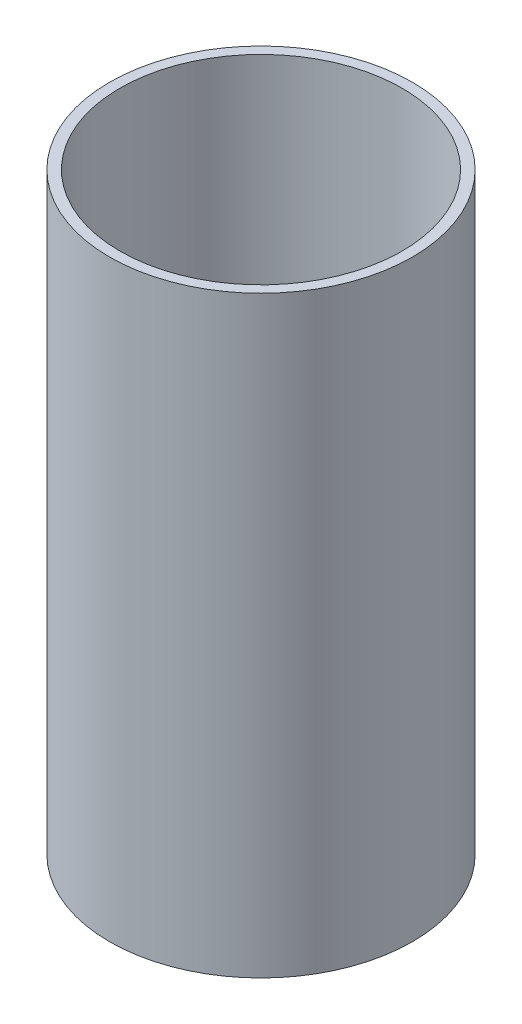
ISO-10303-21;
HEADER;
FILE_DESCRIPTION(('STEP AP214'),'2;1');
FILE_NAME('part.step','',(''),(''),'','','');
FILE_SCHEMA(('AUTOMOTIVE_DESIGN { 1 0 10303 214 1 1 1 1 }'));
ENDSEC;
DATA;
#1=APPLICATION_CONTEXT('core data for automotive mechanical design processes');
#2=APPLICATION_PROTOCOL_DEFINITION('international standard','automotive_design',2000,#1);
#3=PRODUCT_CONTEXT('',#1,'mechanical');
#4=PRODUCT('Part','Part','',(#3));
#5=PRODUCT_RELATED_PRODUCT_CATEGORY('part','',(#4));
#6=PRODUCT_DEFINITION_FORMATION('','',#4);
#7=PRODUCT_DEFINITION_CONTEXT('part definition',#1,'design');
#8=PRODUCT_DEFINITION('design','',#6,#7);
#9=PRODUCT_DEFINITION_SHAPE('','',#8);
#10=(LENGTH_UNIT() NAMED_UNIT(*) SI_UNIT(.MILLI.,.METRE.));
#11=(NAMED_UNIT(*) PLANE_ANGLE_UNIT() SI_UNIT($,.RADIAN.));
#12=(NAMED_UNIT(*) SI_UNIT($,.STERADIAN.) SOLID_ANGLE_UNIT());
#13=UNCERTAINTY_MEASURE_WITH_UNIT(LENGTH_MEASURE(1.E-05),#10,'distance_accuracy_value','');
#14=(GEOMETRIC_REPRESENTATION_CONTEXT(3) GLOBAL_UNCERTAINTY_ASSIGNED_CONTEXT((#13)) GLOBAL_UNIT_ASSIGNED_CONTEXT((#10,
#11,#12)) REPRESENTATION_CONTEXT('',''));
#15=CARTESIAN_POINT('',(0.,0.,0.));
#16=DIRECTION('',(0.,0.,1.));
#17=DIRECTION('',(1.,0.,0.));
#18=AXIS2_PLACEMENT_3D('',#15,#16,#17);
#19=CARTESIAN_POINT('',(0.,75.,0.));
#20=DIRECTION('',(0.,1.,0.));
#21=DIRECTION('',(0.,0.,1.));
#22=AXIS2_PLACEMENT_3D('',#19,#20,#21);
#23=PLANE('',#22);
#24=CARTESIAN_POINT('',(0.,75.,0.));
#25=DIRECTION('',(0.,1.,0.));
#26=DIRECTION('',(0.,0.,1.));
#27=AXIS2_PLACEMENT_3D('',#24,#25,#26);
#28=CIRCLE('',#27,19.15);
#29=CARTESIAN_POINT('',(0.,75.,19.15));
#30=VERTEX_POINT('',#29);
#31=EDGE_CURVE('E10',#30,#30,#28,.T.);
#32=ORIENTED_EDGE('',*,*,#31,.T.);
#33=EDGE_LOOP('',(#32));
#34=FACE_BOUND('',#33,.T.);
#35=CARTESIAN_POINT('',(0.,75.,0.));
#36=DIRECTION('',(0.,1.,0.));
#37=DIRECTION('',(0.,0.,1.));
#38=AXIS2_PLACEMENT_3D('',#35,#36,#37);
#39=CIRCLE('',#38,17.85);
#40=CARTESIAN_POINT('',(0.,75.,17.85));
#41=VERTEX_POINT('',#40);
#42=EDGE_CURVE('E54',#41,#41,#39,.T.);
#43=ORIENTED_EDGE('',*,*,#42,.F.);
#44=EDGE_LOOP('',(#43));
#45=FACE_BOUND('',#44,.T.);
#46=ADVANCED_FACE('F41',(#34,#45),#23,.T.);
#47=CARTESIAN_POINT('',(0.,0.,0.));
#48=DIRECTION('',(0.,1.,0.));
#49=DIRECTION('',(0.,0.,1.));
#50=AXIS2_PLACEMENT_3D('',#47,#48,#49);
#51=PLANE('',#50);
#52=CARTESIAN_POINT('',(0.,0.,0.));
#53=DIRECTION('',(0.,1.,0.));
#54=DIRECTION('',(0.,0.,1.));
#55=AXIS2_PLACEMENT_3D('',#52,#53,#54);
#56=CIRCLE('',#55,19.15);
#57=CARTESIAN_POINT('',(0.,0.,19.15));
#58=VERTEX_POINT('',#57);
#59=EDGE_CURVE('E45',#58,#58,#56,.T.);
#60=ORIENTED_EDGE('',*,*,#59,.F.);
#61=EDGE_LOOP('',(#60));
#62=FACE_BOUND('',#61,.T.);
#63=CARTESIAN_POINT('',(0.,0.,0.));
#64=DIRECTION('',(0.,1.,0.));
#65=DIRECTION('',(0.,0.,1.));
#66=AXIS2_PLACEMENT_3D('',#63,#64,#65);
#67=CIRCLE('',#66,17.85);
#68=CARTESIAN_POINT('',(0.,0.,17.85));
#69=VERTEX_POINT('',#68);
#70=EDGE_CURVE('E56',#69,#69,#67,.T.);
#71=ORIENTED_EDGE('',*,*,#70,.T.);
#72=EDGE_LOOP('',(#71));
#73=FACE_BOUND('',#72,.T.);
#74=ADVANCED_FACE('F68',(#62,#73),#51,.F.);
#75=CARTESIAN_POINT('',(0.,75.,0.));
#76=DIRECTION('',(0.,-1.,0.));
#77=DIRECTION('',(0.,0.,-1.));
#78=AXIS2_PLACEMENT_3D('',#75,#76,#77);
#79=CYLINDRICAL_SURFACE('',#78,19.15);
#80=ORIENTED_EDGE('',*,*,#31,.F.);
#81=EDGE_LOOP('',(#80));
#82=FACE_BOUND('',#81,.T.);
#83=ORIENTED_EDGE('',*,*,#59,.T.);
#84=EDGE_LOOP('',(#83));
#85=FACE_BOUND('',#84,.T.);
#86=ADVANCED_FACE('F43',(#82,#85),#79,.T.);
#87=CARTESIAN_POINT('',(0.,75.,0.));
#88=DIRECTION('',(0.,-1.,0.));
#89=DIRECTION('',(0.,0.,-1.));
#90=AXIS2_PLACEMENT_3D('',#87,#88,#89);
#91=CYLINDRICAL_SURFACE('',#90,17.85);
#92=ORIENTED_EDGE('',*,*,#42,.T.);
#93=EDGE_LOOP('',(#92));
#94=FACE_BOUND('',#93,.T.);
#95=ORIENTED_EDGE('',*,*,#70,.F.);
#96=EDGE_LOOP('',(#95));
#97=FACE_BOUND('',#96,.T.);
#98=ADVANCED_FACE('F64',(#94,#97),#91,.F.);
#99=CLOSED_SHELL('',(#46,#74,#86,#98));
#100=MANIFOLD_SOLID_BREP('B2',#99);
#101=ADVANCED_BREP_SHAPE_REPRESENTATION('',(#18,#100),#14);
#102=SHAPE_DEFINITION_REPRESENTATION(#9,#101);
ENDSEC;
END-ISO-10303-21;
